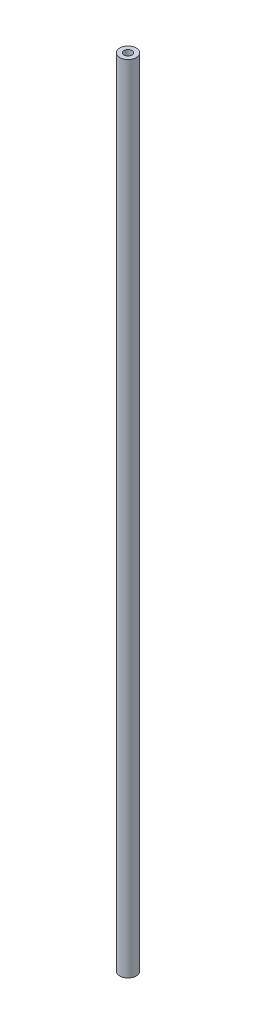
ISO-10303-21;
HEADER;
FILE_DESCRIPTION(('STEP AP214'),'2;1');
FILE_NAME('part.step','',(''),(''),'','','');
FILE_SCHEMA(('AUTOMOTIVE_DESIGN { 1 0 10303 214 1 1 1 1 }'));
ENDSEC;
DATA;
#1=APPLICATION_CONTEXT('core data for automotive mechanical design processes');
#2=APPLICATION_PROTOCOL_DEFINITION('international standard','automotive_design',2000,#1);
#3=PRODUCT_CONTEXT('',#1,'mechanical');
#4=PRODUCT('Part','Part','',(#3));
#5=PRODUCT_RELATED_PRODUCT_CATEGORY('part','',(#4));
#6=PRODUCT_DEFINITION_FORMATION('','',#4);
#7=PRODUCT_DEFINITION_CONTEXT('part definition',#1,'design');
#8=PRODUCT_DEFINITION('design','',#6,#7);
#9=PRODUCT_DEFINITION_SHAPE('','',#8);
#10=(LENGTH_UNIT() NAMED_UNIT(*) SI_UNIT(.MILLI.,.METRE.));
#11=(NAMED_UNIT(*) PLANE_ANGLE_UNIT() SI_UNIT($,.RADIAN.));
#12=(NAMED_UNIT(*) SI_UNIT($,.STERADIAN.) SOLID_ANGLE_UNIT());
#13=UNCERTAINTY_MEASURE_WITH_UNIT(LENGTH_MEASURE(1.E-05),#10,'distance_accuracy_value','');
#14=(GEOMETRIC_REPRESENTATION_CONTEXT(3) GLOBAL_UNCERTAINTY_ASSIGNED_CONTEXT((#13)) GLOBAL_UNIT_ASSIGNED_CONTEXT((#10,
#11,#12)) REPRESENTATION_CONTEXT('',''));
#15=CARTESIAN_POINT('',(0.,0.,0.));
#16=DIRECTION('',(0.,0.,1.));
#17=DIRECTION('',(1.,0.,0.));
#18=AXIS2_PLACEMENT_3D('',#15,#16,#17);
#19=CARTESIAN_POINT('',(0.,304.8,0.));
#20=DIRECTION('',(0.,1.,0.));
#21=DIRECTION('',(0.,0.,1.));
#22=AXIS2_PLACEMENT_3D('',#19,#20,#21);
#23=PLANE('',#22);
#24=CARTESIAN_POINT('',(0.,304.8,0.));
#25=DIRECTION('',(0.,1.,0.));
#26=DIRECTION('',(0.,0.,1.));
#27=AXIS2_PLACEMENT_3D('',#24,#25,#26);
#28=CIRCLE('',#27,3.175);
#29=CARTESIAN_POINT('',(0.,304.8,3.175));
#30=VERTEX_POINT('',#29);
#31=EDGE_CURVE('E10',#30,#30,#28,.T.);
#32=ORIENTED_EDGE('',*,*,#31,.T.);
#33=EDGE_LOOP('',(#32));
#34=FACE_BOUND('',#33,.T.);
#35=CARTESIAN_POINT('',(0.,304.8,0.));
#36=DIRECTION('',(0.,1.,0.));
#37=DIRECTION('',(0.,0.,1.));
#38=AXIS2_PLACEMENT_3D('',#35,#36,#37);
#39=CIRCLE('',#38,1.524);
#40=CARTESIAN_POINT('',(0.,304.8,1.524));
#41=VERTEX_POINT('',#40);
#42=EDGE_CURVE('E50',#41,#41,#39,.T.);
#43=ORIENTED_EDGE('',*,*,#42,.F.);
#44=EDGE_LOOP('',(#43));
#45=FACE_BOUND('',#44,.T.);
#46=ADVANCED_FACE('F37',(#34,#45),#23,.T.);
#47=CARTESIAN_POINT('',(0.,0.,0.));
#48=DIRECTION('',(0.,1.,0.));
#49=DIRECTION('',(0.,0.,1.));
#50=AXIS2_PLACEMENT_3D('',#47,#48,#49);
#51=PLANE('',#50);
#52=CARTESIAN_POINT('',(0.,0.,0.));
#53=DIRECTION('',(0.,1.,0.));
#54=DIRECTION('',(0.,0.,1.));
#55=AXIS2_PLACEMENT_3D('',#52,#53,#54);
#56=CIRCLE('',#55,3.175);
#57=CARTESIAN_POINT('',(0.,0.,3.175));
#58=VERTEX_POINT('',#57);
#59=EDGE_CURVE('E41',#58,#58,#56,.T.);
#60=ORIENTED_EDGE('',*,*,#59,.F.);
#61=EDGE_LOOP('',(#60));
#62=FACE_BOUND('',#61,.T.);
#63=CARTESIAN_POINT('',(0.,0.,0.));
#64=DIRECTION('',(0.,1.,0.));
#65=DIRECTION('',(0.,0.,1.));
#66=AXIS2_PLACEMENT_3D('',#63,#64,#65);
#67=CIRCLE('',#66,1.524);
#68=CARTESIAN_POINT('',(0.,0.,1.524));
#69=VERTEX_POINT('',#68);
#70=EDGE_CURVE('E52',#69,#69,#67,.T.);
#71=ORIENTED_EDGE('',*,*,#70,.T.);
#72=EDGE_LOOP('',(#71));
#73=FACE_BOUND('',#72,.T.);
#74=ADVANCED_FACE('F64',(#62,#73),#51,.F.);
#75=CARTESIAN_POINT('',(0.,304.8,0.));
#76=DIRECTION('',(0.,-1.,0.));
#77=DIRECTION('',(0.,0.,-1.));
#78=AXIS2_PLACEMENT_3D('',#75,#76,#77);
#79=CYLINDRICAL_SURFACE('',#78,3.175);
#80=ORIENTED_EDGE('',*,*,#31,.F.);
#81=EDGE_LOOP('',(#80));
#82=FACE_BOUND('',#81,.T.);
#83=ORIENTED_EDGE('',*,*,#59,.T.);
#84=EDGE_LOOP('',(#83));
#85=FACE_BOUND('',#84,.T.);
#86=ADVANCED_FACE('F39',(#82,#85),#79,.T.);
#87=CARTESIAN_POINT('',(0.,304.8,0.));
#88=DIRECTION('',(0.,-1.,0.));
#89=DIRECTION('',(0.,0.,-1.));
#90=AXIS2_PLACEMENT_3D('',#87,#88,#89);
#91=CYLINDRICAL_SURFACE('',#90,1.524);
#92=ORIENTED_EDGE('',*,*,#42,.T.);
#93=EDGE_LOOP('',(#92));
#94=FACE_BOUND('',#93,.T.);
#95=ORIENTED_EDGE('',*,*,#70,.F.);
#96=EDGE_LOOP('',(#95));
#97=FACE_BOUND('',#96,.T.);
#98=ADVANCED_FACE('F60',(#94,#97),#91,.F.);
#99=CLOSED_SHELL('',(#46,#74,#86,#98));
#100=MANIFOLD_SOLID_BREP('B2',#99);
#101=ADVANCED_BREP_SHAPE_REPRESENTATION('',(#18,#100),#14);
#102=SHAPE_DEFINITION_REPRESENTATION(#9,#101);
ENDSEC;
END-ISO-10303-21;
